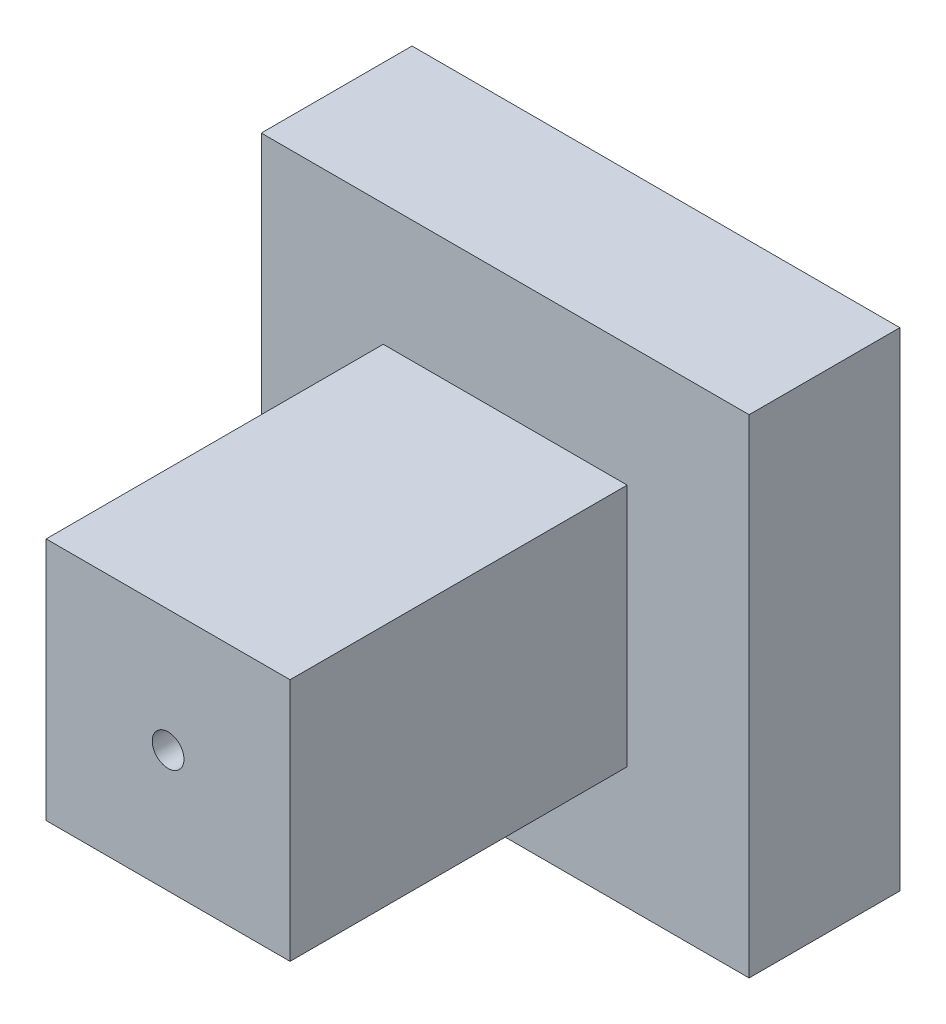
ISO-10303-21;
HEADER;
FILE_DESCRIPTION(('STEP AP214'),'2;1');
FILE_NAME('part.step','',(''),(''),'','','');
FILE_SCHEMA(('AUTOMOTIVE_DESIGN { 1 0 10303 214 1 1 1 1 }'));
ENDSEC;
DATA;
#1=APPLICATION_CONTEXT('core data for automotive mechanical design processes');
#2=APPLICATION_PROTOCOL_DEFINITION('international standard','automotive_design',2000,#1);
#3=PRODUCT_CONTEXT('',#1,'mechanical');
#4=PRODUCT('Part','Part','',(#3));
#5=PRODUCT_RELATED_PRODUCT_CATEGORY('part','',(#4));
#6=PRODUCT_DEFINITION_FORMATION('','',#4);
#7=PRODUCT_DEFINITION_CONTEXT('part definition',#1,'design');
#8=PRODUCT_DEFINITION('design','',#6,#7);
#9=PRODUCT_DEFINITION_SHAPE('','',#8);
#10=(LENGTH_UNIT() NAMED_UNIT(*) SI_UNIT(.MILLI.,.METRE.));
#11=(NAMED_UNIT(*) PLANE_ANGLE_UNIT() SI_UNIT($,.RADIAN.));
#12=(NAMED_UNIT(*) SI_UNIT($,.STERADIAN.) SOLID_ANGLE_UNIT());
#13=UNCERTAINTY_MEASURE_WITH_UNIT(LENGTH_MEASURE(1.E-05),#10,'distance_accuracy_value','');
#14=(GEOMETRIC_REPRESENTATION_CONTEXT(3) GLOBAL_UNCERTAINTY_ASSIGNED_CONTEXT((#13)) GLOBAL_UNIT_ASSIGNED_CONTEXT((#10,
#11,#12)) REPRESENTATION_CONTEXT('',''));
#15=CARTESIAN_POINT('',(0.,0.,0.));
#16=DIRECTION('',(0.,0.,1.));
#17=DIRECTION('',(1.,0.,0.));
#18=AXIS2_PLACEMENT_3D('',#15,#16,#17);
#19=CARTESIAN_POINT('',(-52.3765310087068,38.1979707575598,138.2));
#20=DIRECTION('',(0.,1.,0.));
#21=DIRECTION('',(-1.,0.,0.));
#22=AXIS2_PLACEMENT_3D('',#19,#20,#21);
#23=PLANE('',#22);
#24=DIRECTION('',(1.,0.,0.));
#25=VECTOR('',#24,1.);
#26=CARTESIAN_POINT('',(-52.3765310087068,38.1979707575598,0.));
#27=LINE('',#26,#25);
#28=CARTESIAN_POINT('',(-52.3765310087068,38.1979707575598,0.));
#29=VERTEX_POINT('',#28);
#30=CARTESIAN_POINT('',(47.6234689912931,38.1979707575598,0.));
#31=VERTEX_POINT('',#30);
#32=EDGE_CURVE('E134',#29,#31,#27,.T.);
#33=ORIENTED_EDGE('',*,*,#32,.F.);
#34=DIRECTION('',(0.,0.,-1.));
#35=VECTOR('',#34,1.);
#36=CARTESIAN_POINT('',(-52.3765310087068,38.1979707575598,138.2));
#37=LINE('',#36,#35);
#38=CARTESIAN_POINT('',(-52.3765310087068,38.1979707575598,138.2));
#39=VERTEX_POINT('',#38);
#40=EDGE_CURVE('E11',#39,#29,#37,.T.);
#41=ORIENTED_EDGE('',*,*,#40,.F.);
#42=DIRECTION('',(1.,0.,0.));
#43=VECTOR('',#42,1.);
#44=CARTESIAN_POINT('',(-52.3765310087068,38.1979707575598,138.2));
#45=LINE('',#44,#43);
#46=CARTESIAN_POINT('',(47.6234689912931,38.1979707575598,138.2));
#47=VERTEX_POINT('',#46);
#48=EDGE_CURVE('E139',#39,#47,#45,.T.);
#49=ORIENTED_EDGE('',*,*,#48,.T.);
#50=DIRECTION('',(0.,0.,-1.));
#51=VECTOR('',#50,1.);
#52=CARTESIAN_POINT('',(47.6234689912931,38.1979707575598,138.2));
#53=LINE('',#52,#51);
#54=EDGE_CURVE('E149',#47,#31,#53,.T.);
#55=ORIENTED_EDGE('',*,*,#54,.T.);
#56=EDGE_LOOP('',(#33,#41,#49,#55));
#57=FACE_BOUND('',#56,.T.);
#58=ADVANCED_FACE('F34',(#57),#23,.T.);
#59=CARTESIAN_POINT('',(-52.3765310087068,38.1979707575598,138.2));
#60=DIRECTION('',(1.,0.,0.));
#61=DIRECTION('',(0.,1.,0.));
#62=AXIS2_PLACEMENT_3D('',#59,#60,#61);
#63=PLANE('',#62);
#64=DIRECTION('',(0.,-1.,0.));
#65=VECTOR('',#64,1.);
#66=CARTESIAN_POINT('',(-52.3765310087068,38.1979707575598,0.));
#67=LINE('',#66,#65);
#68=CARTESIAN_POINT('',(-52.3765310087068,-61.8020292424403,0.));
#69=VERTEX_POINT('',#68);
#70=EDGE_CURVE('E142',#29,#69,#67,.T.);
#71=ORIENTED_EDGE('',*,*,#70,.T.);
#72=DIRECTION('',(0.,0.,-1.));
#73=VECTOR('',#72,1.);
#74=CARTESIAN_POINT('',(-52.3765310087068,-61.8020292424403,138.2));
#75=LINE('',#74,#73);
#76=CARTESIAN_POINT('',(-52.3765310087068,-61.8020292424403,138.2));
#77=VERTEX_POINT('',#76);
#78=EDGE_CURVE('E43',#77,#69,#75,.T.);
#79=ORIENTED_EDGE('',*,*,#78,.F.);
#80=DIRECTION('',(0.,-1.,0.));
#81=VECTOR('',#80,1.);
#82=CARTESIAN_POINT('',(-52.3765310087068,38.1979707575598,138.2));
#83=LINE('',#82,#81);
#84=EDGE_CURVE('E147',#39,#77,#83,.T.);
#85=ORIENTED_EDGE('',*,*,#84,.F.);
#86=ORIENTED_EDGE('',*,*,#40,.T.);
#87=EDGE_LOOP('',(#71,#79,#85,#86));
#88=FACE_BOUND('',#87,.T.);
#89=ADVANCED_FACE('F175',(#88),#63,.F.);
#90=CARTESIAN_POINT('',(-52.3765310087068,-61.8020292424403,138.2));
#91=DIRECTION('',(0.,1.,0.));
#92=DIRECTION('',(0.,0.,1.));
#93=AXIS2_PLACEMENT_3D('',#90,#91,#92);
#94=PLANE('',#93);
#95=DIRECTION('',(1.,0.,0.));
#96=VECTOR('',#95,1.);
#97=CARTESIAN_POINT('',(-52.3765310087068,-61.8020292424403,0.));
#98=LINE('',#97,#96);
#99=CARTESIAN_POINT('',(47.6234689912931,-61.8020292424403,0.));
#100=VERTEX_POINT('',#99);
#101=EDGE_CURVE('E153',#69,#100,#98,.T.);
#102=ORIENTED_EDGE('',*,*,#101,.T.);
#103=DIRECTION('',(0.,0.,-1.));
#104=VECTOR('',#103,1.);
#105=CARTESIAN_POINT('',(47.6234689912931,-61.8020292424403,138.2));
#106=LINE('',#105,#104);
#107=CARTESIAN_POINT('',(47.6234689912931,-61.8020292424403,138.2));
#108=VERTEX_POINT('',#107);
#109=EDGE_CURVE('E160',#108,#100,#106,.T.);
#110=ORIENTED_EDGE('',*,*,#109,.F.);
#111=DIRECTION('',(1.,0.,0.));
#112=VECTOR('',#111,1.);
#113=CARTESIAN_POINT('',(-52.3765310087068,-61.8020292424403,138.2));
#114=LINE('',#113,#112);
#115=EDGE_CURVE('E145',#77,#108,#114,.T.);
#116=ORIENTED_EDGE('',*,*,#115,.F.);
#117=ORIENTED_EDGE('',*,*,#78,.T.);
#118=EDGE_LOOP('',(#102,#110,#116,#117));
#119=FACE_BOUND('',#118,.T.);
#120=ADVANCED_FACE('F180',(#119),#94,.F.);
#121=CARTESIAN_POINT('',(47.6234689912931,38.1979707575598,138.2));
#122=DIRECTION('',(1.,0.,0.));
#123=DIRECTION('',(0.,0.,-1.));
#124=AXIS2_PLACEMENT_3D('',#121,#122,#123);
#125=PLANE('',#124);
#126=DIRECTION('',(0.,-1.,0.));
#127=VECTOR('',#126,1.);
#128=CARTESIAN_POINT('',(47.6234689912931,38.1979707575598,0.));
#129=LINE('',#128,#127);
#130=EDGE_CURVE('E151',#31,#100,#129,.T.);
#131=ORIENTED_EDGE('',*,*,#130,.F.);
#132=ORIENTED_EDGE('',*,*,#54,.F.);
#133=DIRECTION('',(0.,-1.,0.));
#134=VECTOR('',#133,1.);
#135=CARTESIAN_POINT('',(47.6234689912931,38.1979707575598,138.2));
#136=LINE('',#135,#134);
#137=EDGE_CURVE('E141',#47,#108,#136,.T.);
#138=ORIENTED_EDGE('',*,*,#137,.T.);
#139=ORIENTED_EDGE('',*,*,#109,.T.);
#140=EDGE_LOOP('',(#131,#132,#138,#139));
#141=FACE_BOUND('',#140,.T.);
#142=ADVANCED_FACE('F167',(#141),#125,.T.);
#143=CARTESIAN_POINT('',(0.,0.,138.2));
#144=DIRECTION('',(0.,0.,-1.));
#145=DIRECTION('',(-1.,0.,0.));
#146=AXIS2_PLACEMENT_3D('',#143,#144,#145);
#147=PLANE('',#146);
#148=CARTESIAN_POINT('',(-2.37653100870682,-11.8020292424403,138.2));
#149=DIRECTION('',(0.,0.,-1.));
#150=DIRECTION('',(-1.,0.,0.));
#151=AXIS2_PLACEMENT_3D('',#148,#149,#150);
#152=CIRCLE('',#151,6.5);
#153=CARTESIAN_POINT('',(-8.87653100870682,-11.8020292424403,138.2));
#154=VERTEX_POINT('',#153);
#155=EDGE_CURVE('E37',#154,#154,#152,.F.);
#156=ORIENTED_EDGE('',*,*,#155,.F.);
#157=EDGE_LOOP('',(#156));
#158=FACE_BOUND('',#157,.T.);
#159=ORIENTED_EDGE('',*,*,#48,.F.);
#160=ORIENTED_EDGE('',*,*,#84,.T.);
#161=ORIENTED_EDGE('',*,*,#115,.T.);
#162=ORIENTED_EDGE('',*,*,#137,.F.);
#163=EDGE_LOOP('',(#159,#160,#161,#162));
#164=FACE_BOUND('',#163,.T.);
#165=ADVANCED_FACE('F178',(#158,#164),#147,.F.);
#166=CARTESIAN_POINT('',(97.623468991293,88.1979707575598,-61.8));
#167=DIRECTION('',(0.,1.,0.));
#168=DIRECTION('',(-1.,0.,0.));
#169=AXIS2_PLACEMENT_3D('',#166,#167,#168);
#170=PLANE('',#169);
#171=DIRECTION('',(-1.,0.,0.));
#172=VECTOR('',#171,1.);
#173=CARTESIAN_POINT('',(97.623468991293,88.1979707575598,0.));
#174=LINE('',#173,#172);
#175=CARTESIAN_POINT('',(97.623468991293,88.1979707575598,0.));
#176=VERTEX_POINT('',#175);
#177=CARTESIAN_POINT('',(-102.376531008706,88.1979707575592,0.));
#178=VERTEX_POINT('',#177);
#179=EDGE_CURVE('E128',#176,#178,#174,.T.);
#180=ORIENTED_EDGE('',*,*,#179,.F.);
#181=DIRECTION('',(0.,0.,1.));
#182=VECTOR('',#181,1.);
#183=CARTESIAN_POINT('',(97.623468991293,88.1979707575598,-61.8));
#184=LINE('',#183,#182);
#185=CARTESIAN_POINT('',(97.623468991293,88.1979707575598,-61.8));
#186=VERTEX_POINT('',#185);
#187=EDGE_CURVE('E117',#186,#176,#184,.T.);
#188=ORIENTED_EDGE('',*,*,#187,.F.);
#189=DIRECTION('',(-1.,0.,0.));
#190=VECTOR('',#189,1.);
#191=CARTESIAN_POINT('',(97.623468991293,88.1979707575598,-61.8));
#192=LINE('',#191,#190);
#193=CARTESIAN_POINT('',(-102.376531008706,88.1979707575592,-61.8));
#194=VERTEX_POINT('',#193);
#195=EDGE_CURVE('E111',#186,#194,#192,.T.);
#196=ORIENTED_EDGE('',*,*,#195,.T.);
#197=DIRECTION('',(0.,0.,1.));
#198=VECTOR('',#197,1.);
#199=CARTESIAN_POINT('',(-102.376531008706,88.1979707575592,-61.8));
#200=LINE('',#199,#198);
#201=EDGE_CURVE('E95',#194,#178,#200,.T.);
#202=ORIENTED_EDGE('',*,*,#201,.T.);
#203=EDGE_LOOP('',(#180,#188,#196,#202));
#204=FACE_BOUND('',#203,.T.);
#205=ADVANCED_FACE('F116',(#204),#170,.T.);
#206=CARTESIAN_POINT('',(97.623468991293,88.1979707575598,-61.8));
#207=DIRECTION('',(-1.,0.,0.));
#208=DIRECTION('',(0.,-1.,0.));
#209=AXIS2_PLACEMENT_3D('',#206,#207,#208);
#210=PLANE('',#209);
#211=DIRECTION('',(0.,-1.,0.));
#212=VECTOR('',#211,1.);
#213=CARTESIAN_POINT('',(97.623468991293,88.1979707575598,0.));
#214=LINE('',#213,#212);
#215=CARTESIAN_POINT('',(97.6234689912937,-111.80202924244,0.));
#216=VERTEX_POINT('',#215);
#217=EDGE_CURVE('E119',#176,#216,#214,.T.);
#218=ORIENTED_EDGE('',*,*,#217,.T.);
#219=DIRECTION('',(0.,0.,1.));
#220=VECTOR('',#219,1.);
#221=CARTESIAN_POINT('',(97.6234689912937,-111.80202924244,-61.8));
#222=LINE('',#221,#220);
#223=CARTESIAN_POINT('',(97.6234689912937,-111.80202924244,-61.8));
#224=VERTEX_POINT('',#223);
#225=EDGE_CURVE('E135',#224,#216,#222,.T.);
#226=ORIENTED_EDGE('',*,*,#225,.F.);
#227=DIRECTION('',(0.,-1.,0.));
#228=VECTOR('',#227,1.);
#229=CARTESIAN_POINT('',(97.623468991293,88.1979707575598,-61.8));
#230=LINE('',#229,#228);
#231=EDGE_CURVE('E106',#186,#224,#230,.T.);
#232=ORIENTED_EDGE('',*,*,#231,.F.);
#233=ORIENTED_EDGE('',*,*,#187,.T.);
#234=EDGE_LOOP('',(#218,#226,#232,#233));
#235=FACE_BOUND('',#234,.T.);
#236=ADVANCED_FACE('F216',(#235),#210,.F.);
#237=CARTESIAN_POINT('',(97.6234689912937,-111.80202924244,-61.8));
#238=DIRECTION('',(0.,1.,0.));
#239=DIRECTION('',(0.,0.,1.));
#240=AXIS2_PLACEMENT_3D('',#237,#238,#239);
#241=PLANE('',#240);
#242=DIRECTION('',(-1.,0.,0.));
#243=VECTOR('',#242,1.);
#244=CARTESIAN_POINT('',(97.6234689912937,-111.80202924244,0.));
#245=LINE('',#244,#243);
#246=CARTESIAN_POINT('',(-102.376531008706,-111.80202924244,0.));
#247=VERTEX_POINT('',#246);
#248=EDGE_CURVE('E121',#216,#247,#245,.T.);
#249=ORIENTED_EDGE('',*,*,#248,.T.);
#250=DIRECTION('',(0.,0.,1.));
#251=VECTOR('',#250,1.);
#252=CARTESIAN_POINT('',(-102.376531008706,-111.80202924244,-61.8));
#253=LINE('',#252,#251);
#254=CARTESIAN_POINT('',(-102.376531008706,-111.80202924244,-61.8));
#255=VERTEX_POINT('',#254);
#256=EDGE_CURVE('E105',#255,#247,#253,.T.);
#257=ORIENTED_EDGE('',*,*,#256,.F.);
#258=DIRECTION('',(-1.,0.,0.));
#259=VECTOR('',#258,1.);
#260=CARTESIAN_POINT('',(97.6234689912937,-111.80202924244,-61.8));
#261=LINE('',#260,#259);
#262=EDGE_CURVE('E113',#224,#255,#261,.T.);
#263=ORIENTED_EDGE('',*,*,#262,.F.);
#264=ORIENTED_EDGE('',*,*,#225,.T.);
#265=EDGE_LOOP('',(#249,#257,#263,#264));
#266=FACE_BOUND('',#265,.T.);
#267=ADVANCED_FACE('F225',(#266),#241,.F.);
#268=CARTESIAN_POINT('',(-102.376531008706,88.1979707575592,-61.8));
#269=DIRECTION('',(-1.,0.,0.));
#270=DIRECTION('',(0.,-1.,0.));
#271=AXIS2_PLACEMENT_3D('',#268,#269,#270);
#272=PLANE('',#271);
#273=DIRECTION('',(0.,-1.,0.));
#274=VECTOR('',#273,1.);
#275=CARTESIAN_POINT('',(-102.376531008706,88.1979707575592,0.));
#276=LINE('',#275,#274);
#277=EDGE_CURVE('E100',#178,#247,#276,.T.);
#278=ORIENTED_EDGE('',*,*,#277,.F.);
#279=ORIENTED_EDGE('',*,*,#201,.F.);
#280=DIRECTION('',(0.,-1.,0.));
#281=VECTOR('',#280,1.);
#282=CARTESIAN_POINT('',(-102.376531008706,88.1979707575592,-61.8));
#283=LINE('',#282,#281);
#284=EDGE_CURVE('E98',#194,#255,#283,.T.);
#285=ORIENTED_EDGE('',*,*,#284,.T.);
#286=ORIENTED_EDGE('',*,*,#256,.T.);
#287=EDGE_LOOP('',(#278,#279,#285,#286));
#288=FACE_BOUND('',#287,.T.);
#289=ADVANCED_FACE('F97',(#288),#272,.T.);
#290=CARTESIAN_POINT('',(0.,0.,-61.8));
#291=DIRECTION('',(0.,0.,1.));
#292=DIRECTION('',(1.,0.,0.));
#293=AXIS2_PLACEMENT_3D('',#290,#291,#292);
#294=PLANE('',#293);
#295=ORIENTED_EDGE('',*,*,#195,.F.);
#296=ORIENTED_EDGE('',*,*,#231,.T.);
#297=ORIENTED_EDGE('',*,*,#262,.T.);
#298=ORIENTED_EDGE('',*,*,#284,.F.);
#299=EDGE_LOOP('',(#295,#296,#297,#298));
#300=FACE_BOUND('',#299,.T.);
#301=ADVANCED_FACE('F110',(#300),#294,.F.);
#302=CARTESIAN_POINT('',(0.,0.,0.));
#303=DIRECTION('',(0.,0.,1.));
#304=DIRECTION('',(1.,0.,0.));
#305=AXIS2_PLACEMENT_3D('',#302,#303,#304);
#306=PLANE('',#305);
#307=ORIENTED_EDGE('',*,*,#70,.F.);
#308=ORIENTED_EDGE('',*,*,#32,.T.);
#309=ORIENTED_EDGE('',*,*,#130,.T.);
#310=ORIENTED_EDGE('',*,*,#101,.F.);
#311=EDGE_LOOP('',(#307,#308,#309,#310));
#312=FACE_BOUND('',#311,.T.);
#313=ORIENTED_EDGE('',*,*,#179,.T.);
#314=ORIENTED_EDGE('',*,*,#277,.T.);
#315=ORIENTED_EDGE('',*,*,#248,.F.);
#316=ORIENTED_EDGE('',*,*,#217,.F.);
#317=EDGE_LOOP('',(#313,#314,#315,#316));
#318=FACE_BOUND('',#317,.T.);
#319=ADVANCED_FACE('F171',(#312,#318),#306,.T.);
#320=CARTESIAN_POINT('',(-2.37653100870682,-11.8020292424403,177.8));
#321=DIRECTION('',(0.,0.,-1.));
#322=DIRECTION('',(-1.,0.,0.));
#323=AXIS2_PLACEMENT_3D('',#320,#321,#322);
#324=CYLINDRICAL_SURFACE('',#323,6.5);
#325=CARTESIAN_POINT('',(-2.37653100870682,-11.8020292424403,0.));
#326=DIRECTION('',(0.,0.,1.));
#327=DIRECTION('',(1.,0.,0.));
#328=AXIS2_PLACEMENT_3D('',#325,#326,#327);
#329=CIRCLE('',#328,6.5);
#330=CARTESIAN_POINT('',(4.12346899129318,-11.8020292424403,0.));
#331=VERTEX_POINT('',#330);
#332=EDGE_CURVE('E124',#331,#331,#329,.T.);
#333=ORIENTED_EDGE('',*,*,#332,.F.);
#334=EDGE_LOOP('',(#333));
#335=FACE_BOUND('',#334,.T.);
#336=ORIENTED_EDGE('',*,*,#155,.T.);
#337=EDGE_LOOP('',(#336));
#338=FACE_BOUND('',#337,.T.);
#339=ADVANCED_FACE('F260',(#335,#338),#324,.F.);
#340=CARTESIAN_POINT('',(-2.37653100870682,-11.8020292424403,0.));
#341=DIRECTION('',(0.,0.,1.));
#342=DIRECTION('',(1.,0.,0.));
#343=AXIS2_PLACEMENT_3D('',#340,#341,#342);
#344=PLANE('',#343);
#345=ORIENTED_EDGE('',*,*,#332,.T.);
#346=EDGE_LOOP('',(#345));
#347=FACE_BOUND('',#346,.T.);
#348=ADVANCED_FACE('F276',(#347),#344,.T.);
#349=CLOSED_SHELL('',(#58,#89,#120,#142,#165,#205,#236,#267,#289,#301,#319,#339,#348));
#350=MANIFOLD_SOLID_BREP('B2',#349);
#351=ADVANCED_BREP_SHAPE_REPRESENTATION('',(#18,#350),#14);
#352=SHAPE_DEFINITION_REPRESENTATION(#9,#351);
ENDSEC;
END-ISO-10303-21;
